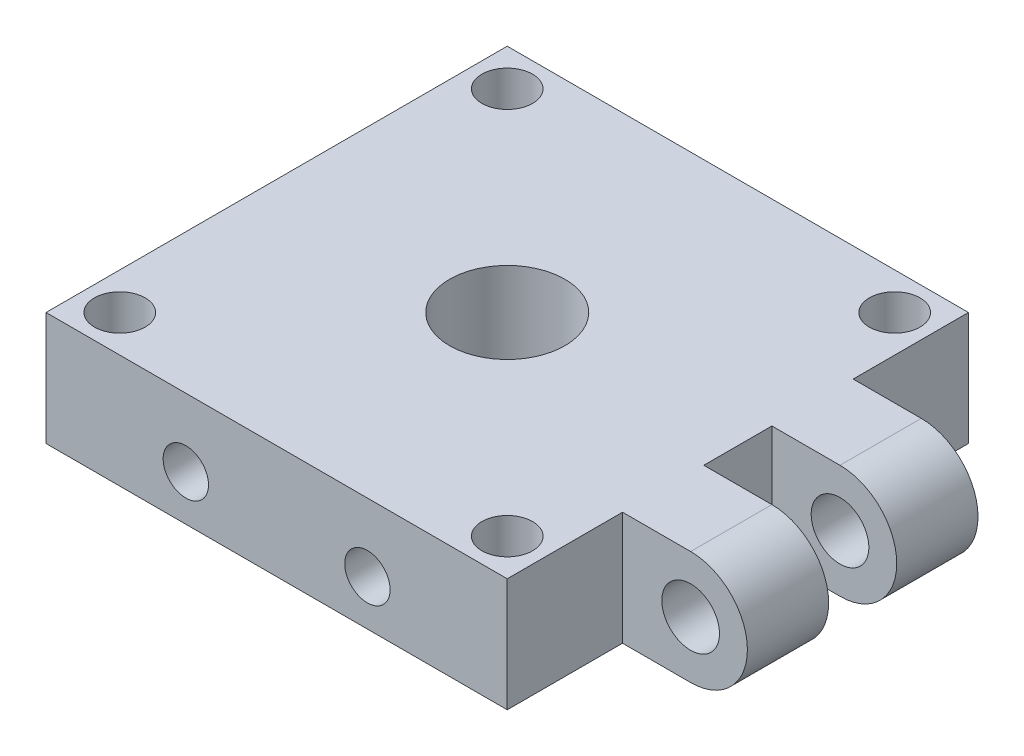
ISO-10303-21;
HEADER;
FILE_DESCRIPTION(('STEP AP214'),'2;1');
FILE_NAME('part.step','',(''),(''),'','','');
FILE_SCHEMA(('AUTOMOTIVE_DESIGN { 1 0 10303 214 1 1 1 1 }'));
ENDSEC;
DATA;
#1=APPLICATION_CONTEXT('core data for automotive mechanical design processes');
#2=APPLICATION_PROTOCOL_DEFINITION('international standard','automotive_design',2000,#1);
#3=PRODUCT_CONTEXT('',#1,'mechanical');
#4=PRODUCT('Part','Part','',(#3));
#5=PRODUCT_RELATED_PRODUCT_CATEGORY('part','',(#4));
#6=PRODUCT_DEFINITION_FORMATION('','',#4);
#7=PRODUCT_DEFINITION_CONTEXT('part definition',#1,'design');
#8=PRODUCT_DEFINITION('design','',#6,#7);
#9=PRODUCT_DEFINITION_SHAPE('','',#8);
#10=(LENGTH_UNIT() NAMED_UNIT(*) SI_UNIT(.MILLI.,.METRE.));
#11=(NAMED_UNIT(*) PLANE_ANGLE_UNIT() SI_UNIT($,.RADIAN.));
#12=(NAMED_UNIT(*) SI_UNIT($,.STERADIAN.) SOLID_ANGLE_UNIT());
#13=UNCERTAINTY_MEASURE_WITH_UNIT(LENGTH_MEASURE(1.E-05),#10,'distance_accuracy_value','');
#14=(GEOMETRIC_REPRESENTATION_CONTEXT(3) GLOBAL_UNCERTAINTY_ASSIGNED_CONTEXT((#13)) GLOBAL_UNIT_ASSIGNED_CONTEXT((#10,
#11,#12)) REPRESENTATION_CONTEXT('',''));
#15=CARTESIAN_POINT('',(0.,0.,0.));
#16=DIRECTION('',(0.,0.,1.));
#17=DIRECTION('',(1.,0.,0.));
#18=AXIS2_PLACEMENT_3D('',#15,#16,#17);
#19=CARTESIAN_POINT('',(-10.,5.,5.4));
#20=DIRECTION('',(0.,0.,1.));
#21=DIRECTION('',(1.,0.,0.));
#22=AXIS2_PLACEMENT_3D('',#19,#20,#21);
#23=CYLINDRICAL_SURFACE('',#22,2.5);
#24=CARTESIAN_POINT('',(-10.,5.,25.4));
#25=DIRECTION('',(0.,0.,1.));
#26=DIRECTION('',(1.,0.,0.));
#27=AXIS2_PLACEMENT_3D('',#24,#25,#26);
#28=CIRCLE('',#27,2.5);
#29=CARTESIAN_POINT('',(-7.5,5.,25.4));
#30=VERTEX_POINT('',#29);
#31=EDGE_CURVE('E282',#30,#30,#28,.T.);
#32=ORIENTED_EDGE('',*,*,#31,.T.);
#33=EDGE_LOOP('',(#32));
#34=FACE_BOUND('',#33,.T.);
#35=CARTESIAN_POINT('',(-10.,5.,10.));
#36=DIRECTION('',(0.707106781186547,0.,0.707106781186547));
#37=DIRECTION('',(-0.707106781186547,0.,0.707106781186547));
#38=AXIS2_PLACEMENT_3D('',#35,#36,#37);
#39=ELLIPSE('',#38,3.53553390593274,2.5);
#40=CARTESIAN_POINT('',(-10.,2.5,10.));
#41=VERTEX_POINT('',#40);
#42=CARTESIAN_POINT('',(-10.,7.5,10.));
#43=VERTEX_POINT('',#42);
#44=EDGE_CURVE('E54',#41,#43,#39,.F.);
#45=ORIENTED_EDGE('',*,*,#44,.T.);
#46=CARTESIAN_POINT('',(-10.,5.,10.));
#47=DIRECTION('',(-0.707106781186547,0.,0.707106781186547));
#48=DIRECTION('',(0.707106781186547,0.,0.707106781186547));
#49=AXIS2_PLACEMENT_3D('',#46,#47,#48);
#50=ELLIPSE('',#49,3.53553390593274,2.5);
#51=EDGE_CURVE('E11',#43,#41,#50,.F.);
#52=ORIENTED_EDGE('',*,*,#51,.T.);
#53=EDGE_LOOP('',(#45,#52));
#54=FACE_BOUND('',#53,.T.);
#55=ADVANCED_FACE('F41',(#34,#54),#23,.F.);
#56=CARTESIAN_POINT('',(32.9,6.25,12.7));
#57=DIRECTION('',(0.,0.,-1.));
#58=DIRECTION('',(-1.,0.,0.));
#59=AXIS2_PLACEMENT_3D('',#56,#57,#58);
#60=CYLINDRICAL_SURFACE('',#59,6.25);
#61=CARTESIAN_POINT('',(32.9,6.25,3.75));
#62=DIRECTION('',(0.,0.,1.));
#63=DIRECTION('',(1.,0.,0.));
#64=AXIS2_PLACEMENT_3D('',#61,#62,#63);
#65=CIRCLE('',#64,6.25);
#66=CARTESIAN_POINT('',(32.9,0.,3.75));
#67=VERTEX_POINT('',#66);
#68=CARTESIAN_POINT('',(32.9,12.5,3.75));
#69=VERTEX_POINT('',#68);
#70=EDGE_CURVE('E151',#67,#69,#65,.T.);
#71=ORIENTED_EDGE('',*,*,#70,.T.);
#72=DIRECTION('',(0.,0.,-1.));
#73=VECTOR('',#72,1.);
#74=CARTESIAN_POINT('',(32.9,12.5,12.7));
#75=LINE('',#74,#73);
#76=CARTESIAN_POINT('',(32.9,12.5,12.7));
#77=VERTEX_POINT('',#76);
#78=EDGE_CURVE('E220',#77,#69,#75,.T.);
#79=ORIENTED_EDGE('',*,*,#78,.F.);
#80=CARTESIAN_POINT('',(32.9,6.25,12.7));
#81=DIRECTION('',(0.,0.,1.));
#82=DIRECTION('',(-1.,0.,0.));
#83=AXIS2_PLACEMENT_3D('',#80,#81,#82);
#84=CIRCLE('',#83,6.25);
#85=CARTESIAN_POINT('',(32.9,0.,12.7));
#86=VERTEX_POINT('',#85);
#87=EDGE_CURVE('E240',#86,#77,#84,.T.);
#88=ORIENTED_EDGE('',*,*,#87,.F.);
#89=DIRECTION('',(0.,0.,-1.));
#90=VECTOR('',#89,1.);
#91=CARTESIAN_POINT('',(32.9,0.,12.7));
#92=LINE('',#91,#90);
#93=EDGE_CURVE('E214',#86,#67,#92,.T.);
#94=ORIENTED_EDGE('',*,*,#93,.T.);
#95=EDGE_LOOP('',(#71,#79,#88,#94));
#96=FACE_BOUND('',#95,.T.);
#97=ADVANCED_FACE('F344',(#96),#60,.T.);
#98=CARTESIAN_POINT('',(32.9,6.25,12.7));
#99=DIRECTION('',(0.,0.,-1.));
#100=DIRECTION('',(-1.,0.,0.));
#101=AXIS2_PLACEMENT_3D('',#98,#99,#100);
#102=CYLINDRICAL_SURFACE('',#101,3.175);
#103=CARTESIAN_POINT('',(32.9,6.25,3.75));
#104=DIRECTION('',(0.,0.,1.));
#105=DIRECTION('',(1.,0.,0.));
#106=AXIS2_PLACEMENT_3D('',#103,#104,#105);
#107=CIRCLE('',#106,3.175);
#108=CARTESIAN_POINT('',(36.075,6.25,3.75));
#109=VERTEX_POINT('',#108);
#110=EDGE_CURVE('E148',#109,#109,#107,.T.);
#111=ORIENTED_EDGE('',*,*,#110,.F.);
#112=EDGE_LOOP('',(#111));
#113=FACE_BOUND('',#112,.T.);
#114=CARTESIAN_POINT('',(32.9,6.25,12.7));
#115=DIRECTION('',(0.,0.,1.));
#116=DIRECTION('',(1.,0.,0.));
#117=AXIS2_PLACEMENT_3D('',#114,#115,#116);
#118=CIRCLE('',#117,3.175);
#119=CARTESIAN_POINT('',(36.075,6.25,12.7));
#120=VERTEX_POINT('',#119);
#121=EDGE_CURVE('E236',#120,#120,#118,.T.);
#122=ORIENTED_EDGE('',*,*,#121,.T.);
#123=EDGE_LOOP('',(#122));
#124=FACE_BOUND('',#123,.T.);
#125=ADVANCED_FACE('F378',(#113,#124),#102,.F.);
#126=CARTESIAN_POINT('',(25.4,12.5,25.4));
#127=DIRECTION('',(-1.,0.,0.));
#128=DIRECTION('',(0.,0.,1.));
#129=AXIS2_PLACEMENT_3D('',#126,#127,#128);
#130=PLANE('',#129);
#131=DIRECTION('',(0.,-1.,0.));
#132=VECTOR('',#131,1.);
#133=CARTESIAN_POINT('',(25.4,0.,12.7));
#134=LINE('',#133,#132);
#135=CARTESIAN_POINT('',(25.4,12.5,12.7));
#136=VERTEX_POINT('',#135);
#137=CARTESIAN_POINT('',(25.4,0.,12.7));
#138=VERTEX_POINT('',#137);
#139=EDGE_CURVE('E227',#136,#138,#134,.T.);
#140=ORIENTED_EDGE('',*,*,#139,.F.);
#141=DIRECTION('',(0.,0.,-1.));
#142=VECTOR('',#141,1.);
#143=CARTESIAN_POINT('',(25.4,12.5,25.4));
#144=LINE('',#143,#142);
#145=CARTESIAN_POINT('',(25.4,12.5,25.4));
#146=VERTEX_POINT('',#145);
#147=EDGE_CURVE('E183',#146,#136,#144,.T.);
#148=ORIENTED_EDGE('',*,*,#147,.F.);
#149=DIRECTION('',(0.,-1.,0.));
#150=VECTOR('',#149,1.);
#151=CARTESIAN_POINT('',(25.4,12.5,25.4));
#152=LINE('',#151,#150);
#153=CARTESIAN_POINT('',(25.4,0.,25.4));
#154=VERTEX_POINT('',#153);
#155=EDGE_CURVE('E164',#146,#154,#152,.T.);
#156=ORIENTED_EDGE('',*,*,#155,.T.);
#157=DIRECTION('',(0.,0.,-1.));
#158=VECTOR('',#157,1.);
#159=CARTESIAN_POINT('',(25.4,0.,25.4));
#160=LINE('',#159,#158);
#161=EDGE_CURVE('E175',#154,#138,#160,.T.);
#162=ORIENTED_EDGE('',*,*,#161,.T.);
#163=EDGE_LOOP('',(#140,#148,#156,#162));
#164=FACE_BOUND('',#163,.T.);
#165=ADVANCED_FACE('F332',(#164),#130,.F.);
#166=CARTESIAN_POINT('',(0.,12.5,0.));
#167=DIRECTION('',(0.,-1.,0.));
#168=DIRECTION('',(0.,0.,-1.));
#169=AXIS2_PLACEMENT_3D('',#166,#167,#168);
#170=PLANE('',#169);
#171=ORIENTED_EDGE('',*,*,#78,.T.);
#172=DIRECTION('',(1.,0.,0.));
#173=VECTOR('',#172,1.);
#174=CARTESIAN_POINT('',(25.4,12.5,3.75));
#175=LINE('',#174,#173);
#176=CARTESIAN_POINT('',(25.4,12.5,3.75));
#177=VERTEX_POINT('',#176);
#178=EDGE_CURVE('E258',#177,#69,#175,.T.);
#179=ORIENTED_EDGE('',*,*,#178,.F.);
#180=DIRECTION('',(0.,0.,1.));
#181=VECTOR('',#180,1.);
#182=CARTESIAN_POINT('',(25.4,12.5,-3.75));
#183=LINE('',#182,#181);
#184=CARTESIAN_POINT('',(25.4,12.5,-3.75));
#185=VERTEX_POINT('',#184);
#186=EDGE_CURVE('E262',#185,#177,#183,.T.);
#187=ORIENTED_EDGE('',*,*,#186,.F.);
#188=DIRECTION('',(-1.,0.,0.));
#189=VECTOR('',#188,1.);
#190=CARTESIAN_POINT('',(25.4,12.5,-3.75));
#191=LINE('',#190,#189);
#192=CARTESIAN_POINT('',(32.9,12.5,-3.75));
#193=VERTEX_POINT('',#192);
#194=EDGE_CURVE('E265',#193,#185,#191,.T.);
#195=ORIENTED_EDGE('',*,*,#194,.F.);
#196=CARTESIAN_POINT('',(32.9,12.5,-12.7));
#197=VERTEX_POINT('',#196);
#198=EDGE_CURVE('E223',#193,#197,#75,.T.);
#199=ORIENTED_EDGE('',*,*,#198,.T.);
#200=DIRECTION('',(-1.,0.,0.));
#201=VECTOR('',#200,1.);
#202=CARTESIAN_POINT('',(25.4,12.5,-12.7));
#203=LINE('',#202,#201);
#204=CARTESIAN_POINT('',(25.4,12.5,-12.7));
#205=VERTEX_POINT('',#204);
#206=EDGE_CURVE('E224',#197,#205,#203,.T.);
#207=ORIENTED_EDGE('',*,*,#206,.T.);
#208=CARTESIAN_POINT('',(25.4,12.5,-25.4));
#209=VERTEX_POINT('',#208);
#210=EDGE_CURVE('E170',#205,#209,#144,.T.);
#211=ORIENTED_EDGE('',*,*,#210,.T.);
#212=DIRECTION('',(-1.,0.,0.));
#213=VECTOR('',#212,1.);
#214=CARTESIAN_POINT('',(-25.4,12.5,-25.4));
#215=LINE('',#214,#213);
#216=CARTESIAN_POINT('',(-25.4,12.5,-25.4));
#217=VERTEX_POINT('',#216);
#218=EDGE_CURVE('E181',#209,#217,#215,.T.);
#219=ORIENTED_EDGE('',*,*,#218,.T.);
#220=DIRECTION('',(0.,0.,1.));
#221=VECTOR('',#220,1.);
#222=CARTESIAN_POINT('',(-25.4,12.5,25.4));
#223=LINE('',#222,#221);
#224=CARTESIAN_POINT('',(-25.4,12.5,25.4));
#225=VERTEX_POINT('',#224);
#226=EDGE_CURVE('E179',#217,#225,#223,.T.);
#227=ORIENTED_EDGE('',*,*,#226,.T.);
#228=DIRECTION('',(1.,0.,0.));
#229=VECTOR('',#228,1.);
#230=CARTESIAN_POINT('',(-25.4,12.5,25.4));
#231=LINE('',#230,#229);
#232=EDGE_CURVE('E167',#225,#146,#231,.T.);
#233=ORIENTED_EDGE('',*,*,#232,.T.);
#234=ORIENTED_EDGE('',*,*,#147,.T.);
#235=DIRECTION('',(-1.,0.,0.));
#236=VECTOR('',#235,1.);
#237=CARTESIAN_POINT('',(25.4,12.5,12.7));
#238=LINE('',#237,#236);
#239=EDGE_CURVE('E237',#77,#136,#238,.T.);
#240=ORIENTED_EDGE('',*,*,#239,.F.);
#241=EDGE_LOOP('',(#171,#179,#187,#195,#199,#207,#211,#219,#227,#233,#234,#240));
#242=FACE_BOUND('',#241,.T.);
#243=CARTESIAN_POINT('',(-21.336,12.5,21.336));
#244=DIRECTION('',(0.,1.,0.));
#245=DIRECTION('',(0.,0.,1.));
#246=AXIS2_PLACEMENT_3D('',#243,#244,#245);
#247=CIRCLE('',#246,2.794);
#248=CARTESIAN_POINT('',(-21.336,12.5,24.13));
#249=VERTEX_POINT('',#248);
#250=EDGE_CURVE('E189',#249,#249,#247,.T.);
#251=ORIENTED_EDGE('',*,*,#250,.F.);
#252=EDGE_LOOP('',(#251));
#253=FACE_BOUND('',#252,.T.);
#254=CARTESIAN_POINT('',(21.336,12.5,21.336));
#255=DIRECTION('',(0.,1.,0.));
#256=DIRECTION('',(0.,0.,1.));
#257=AXIS2_PLACEMENT_3D('',#254,#255,#256);
#258=CIRCLE('',#257,2.794);
#259=CARTESIAN_POINT('',(21.336,12.5,24.13));
#260=VERTEX_POINT('',#259);
#261=EDGE_CURVE('E190',#260,#260,#258,.T.);
#262=ORIENTED_EDGE('',*,*,#261,.F.);
#263=EDGE_LOOP('',(#262));
#264=FACE_BOUND('',#263,.T.);
#265=CARTESIAN_POINT('',(21.336,12.5,-21.336));
#266=DIRECTION('',(0.,1.,0.));
#267=DIRECTION('',(0.,0.,1.));
#268=AXIS2_PLACEMENT_3D('',#265,#266,#267);
#269=CIRCLE('',#268,2.794);
#270=CARTESIAN_POINT('',(21.336,12.5,-18.542));
#271=VERTEX_POINT('',#270);
#272=EDGE_CURVE('E196',#271,#271,#269,.T.);
#273=ORIENTED_EDGE('',*,*,#272,.F.);
#274=EDGE_LOOP('',(#273));
#275=FACE_BOUND('',#274,.T.);
#276=CARTESIAN_POINT('',(-21.336,12.5,-21.336));
#277=DIRECTION('',(0.,1.,0.));
#278=DIRECTION('',(0.,0.,1.));
#279=AXIS2_PLACEMENT_3D('',#276,#277,#278);
#280=CIRCLE('',#279,2.794);
#281=CARTESIAN_POINT('',(-21.336,12.5,-18.542));
#282=VERTEX_POINT('',#281);
#283=EDGE_CURVE('E202',#282,#282,#280,.T.);
#284=ORIENTED_EDGE('',*,*,#283,.F.);
#285=EDGE_LOOP('',(#284));
#286=FACE_BOUND('',#285,.T.);
#287=CARTESIAN_POINT('',(0.,12.5,0.));
#288=DIRECTION('',(0.,1.,0.));
#289=DIRECTION('',(0.,0.,1.));
#290=AXIS2_PLACEMENT_3D('',#287,#288,#289);
#291=CIRCLE('',#290,6.35);
#292=CARTESIAN_POINT('',(0.,12.5,6.35000000000001));
#293=VERTEX_POINT('',#292);
#294=EDGE_CURVE('E208',#293,#293,#291,.T.);
#295=ORIENTED_EDGE('',*,*,#294,.F.);
#296=EDGE_LOOP('',(#295));
#297=FACE_BOUND('',#296,.T.);
#298=ADVANCED_FACE('F336',(#242,#253,#264,#275,#286,#297),#170,.F.);
#299=CARTESIAN_POINT('',(0.,0.,0.));
#300=DIRECTION('',(0.,-1.,0.));
#301=DIRECTION('',(0.,0.,-1.));
#302=AXIS2_PLACEMENT_3D('',#299,#300,#301);
#303=PLANE('',#302);
#304=DIRECTION('',(1.,0.,0.));
#305=VECTOR('',#304,1.);
#306=CARTESIAN_POINT('',(25.4,0.,3.75));
#307=LINE('',#306,#305);
#308=CARTESIAN_POINT('',(25.4,0.,3.75));
#309=VERTEX_POINT('',#308);
#310=EDGE_CURVE('E256',#309,#67,#307,.T.);
#311=ORIENTED_EDGE('',*,*,#310,.T.);
#312=ORIENTED_EDGE('',*,*,#93,.F.);
#313=DIRECTION('',(1.,0.,0.));
#314=VECTOR('',#313,1.);
#315=CARTESIAN_POINT('',(25.4,0.,12.7));
#316=LINE('',#315,#314);
#317=EDGE_CURVE('E242',#138,#86,#316,.T.);
#318=ORIENTED_EDGE('',*,*,#317,.F.);
#319=ORIENTED_EDGE('',*,*,#161,.F.);
#320=DIRECTION('',(1.,0.,0.));
#321=VECTOR('',#320,1.);
#322=CARTESIAN_POINT('',(-25.4,0.,25.4));
#323=LINE('',#322,#321);
#324=CARTESIAN_POINT('',(-25.4,0.,25.4));
#325=VERTEX_POINT('',#324);
#326=EDGE_CURVE('E168',#325,#154,#323,.T.);
#327=ORIENTED_EDGE('',*,*,#326,.F.);
#328=DIRECTION('',(0.,0.,1.));
#329=VECTOR('',#328,1.);
#330=CARTESIAN_POINT('',(-25.4,0.,25.4));
#331=LINE('',#330,#329);
#332=CARTESIAN_POINT('',(-25.4,0.,-25.4));
#333=VERTEX_POINT('',#332);
#334=EDGE_CURVE('E171',#333,#325,#331,.T.);
#335=ORIENTED_EDGE('',*,*,#334,.F.);
#336=DIRECTION('',(-1.,0.,0.));
#337=VECTOR('',#336,1.);
#338=CARTESIAN_POINT('',(-25.4,0.,-25.4));
#339=LINE('',#338,#337);
#340=CARTESIAN_POINT('',(25.4,0.,-25.4));
#341=VERTEX_POINT('',#340);
#342=EDGE_CURVE('E173',#341,#333,#339,.T.);
#343=ORIENTED_EDGE('',*,*,#342,.F.);
#344=CARTESIAN_POINT('',(25.4,0.,-12.7));
#345=VERTEX_POINT('',#344);
#346=EDGE_CURVE('E177',#345,#341,#160,.T.);
#347=ORIENTED_EDGE('',*,*,#346,.F.);
#348=DIRECTION('',(1.,0.,0.));
#349=VECTOR('',#348,1.);
#350=CARTESIAN_POINT('',(25.4,0.,-12.7));
#351=LINE('',#350,#349);
#352=CARTESIAN_POINT('',(32.9,0.,-12.7));
#353=VERTEX_POINT('',#352);
#354=EDGE_CURVE('E231',#345,#353,#351,.T.);
#355=ORIENTED_EDGE('',*,*,#354,.T.);
#356=CARTESIAN_POINT('',(32.9,0.,-3.75));
#357=VERTEX_POINT('',#356);
#358=EDGE_CURVE('E219',#357,#353,#92,.T.);
#359=ORIENTED_EDGE('',*,*,#358,.F.);
#360=DIRECTION('',(-1.,0.,0.));
#361=VECTOR('',#360,1.);
#362=CARTESIAN_POINT('',(25.4,0.,-3.75));
#363=LINE('',#362,#361);
#364=CARTESIAN_POINT('',(25.4,0.,-3.75));
#365=VERTEX_POINT('',#364);
#366=EDGE_CURVE('E261',#357,#365,#363,.T.);
#367=ORIENTED_EDGE('',*,*,#366,.T.);
#368=DIRECTION('',(0.,0.,1.));
#369=VECTOR('',#368,1.);
#370=CARTESIAN_POINT('',(25.4,0.,-3.75));
#371=LINE('',#370,#369);
#372=EDGE_CURVE('E270',#365,#309,#371,.T.);
#373=ORIENTED_EDGE('',*,*,#372,.T.);
#374=EDGE_LOOP('',(#311,#312,#318,#319,#327,#335,#343,#347,#355,#359,#367,#373));
#375=FACE_BOUND('',#374,.T.);
#376=CARTESIAN_POINT('',(-21.336,0.,-21.336));
#377=DIRECTION('',(0.,1.,0.));
#378=DIRECTION('',(0.,0.,1.));
#379=AXIS2_PLACEMENT_3D('',#376,#377,#378);
#380=CIRCLE('',#379,2.794);
#381=CARTESIAN_POINT('',(-21.336,0.,-18.542));
#382=VERTEX_POINT('',#381);
#383=EDGE_CURVE('E205',#382,#382,#380,.T.);
#384=ORIENTED_EDGE('',*,*,#383,.T.);
#385=EDGE_LOOP('',(#384));
#386=FACE_BOUND('',#385,.T.);
#387=CARTESIAN_POINT('',(21.336,0.,21.336));
#388=DIRECTION('',(0.,1.,0.));
#389=DIRECTION('',(0.,0.,1.));
#390=AXIS2_PLACEMENT_3D('',#387,#388,#389);
#391=CIRCLE('',#390,2.794);
#392=CARTESIAN_POINT('',(21.336,0.,24.13));
#393=VERTEX_POINT('',#392);
#394=EDGE_CURVE('E193',#393,#393,#391,.T.);
#395=ORIENTED_EDGE('',*,*,#394,.T.);
#396=EDGE_LOOP('',(#395));
#397=FACE_BOUND('',#396,.T.);
#398=CARTESIAN_POINT('',(-21.336,0.,21.336));
#399=DIRECTION('',(0.,1.,0.));
#400=DIRECTION('',(0.,0.,1.));
#401=AXIS2_PLACEMENT_3D('',#398,#399,#400);
#402=CIRCLE('',#401,2.794);
#403=CARTESIAN_POINT('',(-21.336,0.,24.13));
#404=VERTEX_POINT('',#403);
#405=EDGE_CURVE('E186',#404,#404,#402,.T.);
#406=ORIENTED_EDGE('',*,*,#405,.T.);
#407=EDGE_LOOP('',(#406));
#408=FACE_BOUND('',#407,.T.);
#409=CARTESIAN_POINT('',(21.336,0.,-21.336));
#410=DIRECTION('',(0.,1.,0.));
#411=DIRECTION('',(0.,0.,1.));
#412=AXIS2_PLACEMENT_3D('',#409,#410,#411);
#413=CIRCLE('',#412,2.794);
#414=CARTESIAN_POINT('',(21.336,0.,-18.542));
#415=VERTEX_POINT('',#414);
#416=EDGE_CURVE('E199',#415,#415,#413,.T.);
#417=ORIENTED_EDGE('',*,*,#416,.T.);
#418=EDGE_LOOP('',(#417));
#419=FACE_BOUND('',#418,.T.);
#420=CARTESIAN_POINT('',(0.,0.,0.));
#421=DIRECTION('',(0.,1.,0.));
#422=DIRECTION('',(0.,0.,1.));
#423=AXIS2_PLACEMENT_3D('',#420,#421,#422);
#424=CIRCLE('',#423,6.35);
#425=CARTESIAN_POINT('',(0.,0.,6.35000000000001));
#426=VERTEX_POINT('',#425);
#427=EDGE_CURVE('E211',#426,#426,#424,.T.);
#428=ORIENTED_EDGE('',*,*,#427,.T.);
#429=EDGE_LOOP('',(#428));
#430=FACE_BOUND('',#429,.T.);
#431=ADVANCED_FACE('F327',(#375,#386,#397,#408,#419,#430),#303,.T.);
#432=ORIENTED_EDGE('',*,*,#210,.F.);
#433=DIRECTION('',(0.,-1.,0.));
#434=VECTOR('',#433,1.);
#435=CARTESIAN_POINT('',(25.4,0.,-12.7));
#436=LINE('',#435,#434);
#437=EDGE_CURVE('E234',#205,#345,#436,.T.);
#438=ORIENTED_EDGE('',*,*,#437,.T.);
#439=ORIENTED_EDGE('',*,*,#346,.T.);
#440=DIRECTION('',(0.,-1.,0.));
#441=VECTOR('',#440,1.);
#442=CARTESIAN_POINT('',(25.4,12.5,-25.4));
#443=LINE('',#442,#441);
#444=EDGE_CURVE('E143',#209,#341,#443,.T.);
#445=ORIENTED_EDGE('',*,*,#444,.F.);
#446=EDGE_LOOP('',(#432,#438,#439,#445));
#447=FACE_BOUND('',#446,.T.);
#448=ADVANCED_FACE('F43',(#447),#130,.F.);
#449=CARTESIAN_POINT('',(-25.4,12.5,-25.4));
#450=DIRECTION('',(0.,0.,1.));
#451=DIRECTION('',(1.,0.,0.));
#452=AXIS2_PLACEMENT_3D('',#449,#450,#451);
#453=PLANE('',#452);
#454=ORIENTED_EDGE('',*,*,#342,.T.);
#455=DIRECTION('',(0.,-1.,0.));
#456=VECTOR('',#455,1.);
#457=CARTESIAN_POINT('',(-25.4,12.5,-25.4));
#458=LINE('',#457,#456);
#459=EDGE_CURVE('E158',#217,#333,#458,.T.);
#460=ORIENTED_EDGE('',*,*,#459,.F.);
#461=ORIENTED_EDGE('',*,*,#218,.F.);
#462=ORIENTED_EDGE('',*,*,#444,.T.);
#463=EDGE_LOOP('',(#454,#460,#461,#462));
#464=FACE_BOUND('',#463,.T.);
#465=ADVANCED_FACE('F312',(#464),#453,.F.);
#466=CARTESIAN_POINT('',(-25.4,12.5,25.4));
#467=DIRECTION('',(1.,0.,0.));
#468=DIRECTION('',(0.,0.,-1.));
#469=AXIS2_PLACEMENT_3D('',#466,#467,#468);
#470=PLANE('',#469);
#471=CARTESIAN_POINT('',(-25.4,5.,-10.));
#472=DIRECTION('',(-1.,0.,0.));
#473=DIRECTION('',(0.,0.,1.));
#474=AXIS2_PLACEMENT_3D('',#471,#472,#473);
#475=CIRCLE('',#474,2.5);
#476=CARTESIAN_POINT('',(-25.4,5.,-7.5));
#477=VERTEX_POINT('',#476);
#478=EDGE_CURVE('E293',#477,#477,#475,.T.);
#479=ORIENTED_EDGE('',*,*,#478,.F.);
#480=EDGE_LOOP('',(#479));
#481=FACE_BOUND('',#480,.T.);
#482=CARTESIAN_POINT('',(-25.4,5.,10.));
#483=DIRECTION('',(-1.,0.,0.));
#484=DIRECTION('',(0.,0.,1.));
#485=AXIS2_PLACEMENT_3D('',#482,#483,#484);
#486=CIRCLE('',#485,2.5);
#487=CARTESIAN_POINT('',(-25.4,5.,12.5));
#488=VERTEX_POINT('',#487);
#489=EDGE_CURVE('E290',#488,#488,#486,.T.);
#490=ORIENTED_EDGE('',*,*,#489,.F.);
#491=EDGE_LOOP('',(#490));
#492=FACE_BOUND('',#491,.T.);
#493=ORIENTED_EDGE('',*,*,#334,.T.);
#494=DIRECTION('',(0.,-1.,0.));
#495=VECTOR('',#494,1.);
#496=CARTESIAN_POINT('',(-25.4,12.5,25.4));
#497=LINE('',#496,#495);
#498=EDGE_CURVE('E161',#225,#325,#497,.T.);
#499=ORIENTED_EDGE('',*,*,#498,.F.);
#500=ORIENTED_EDGE('',*,*,#226,.F.);
#501=ORIENTED_EDGE('',*,*,#459,.T.);
#502=EDGE_LOOP('',(#493,#499,#500,#501));
#503=FACE_BOUND('',#502,.T.);
#504=ADVANCED_FACE('F308',(#481,#492,#503),#470,.F.);
#505=CARTESIAN_POINT('',(-25.4,12.5,25.4));
#506=DIRECTION('',(0.,0.,-1.));
#507=DIRECTION('',(-1.,0.,0.));
#508=AXIS2_PLACEMENT_3D('',#505,#506,#507);
#509=PLANE('',#508);
#510=ORIENTED_EDGE('',*,*,#31,.F.);
#511=EDGE_LOOP('',(#510));
#512=FACE_BOUND('',#511,.T.);
#513=CARTESIAN_POINT('',(10.,5.,25.4));
#514=DIRECTION('',(0.,0.,1.));
#515=DIRECTION('',(1.,0.,0.));
#516=AXIS2_PLACEMENT_3D('',#513,#514,#515);
#517=CIRCLE('',#516,2.5);
#518=CARTESIAN_POINT('',(12.5,5.,25.4));
#519=VERTEX_POINT('',#518);
#520=EDGE_CURVE('E278',#519,#519,#517,.T.);
#521=ORIENTED_EDGE('',*,*,#520,.F.);
#522=EDGE_LOOP('',(#521));
#523=FACE_BOUND('',#522,.T.);
#524=ORIENTED_EDGE('',*,*,#326,.T.);
#525=ORIENTED_EDGE('',*,*,#155,.F.);
#526=ORIENTED_EDGE('',*,*,#232,.F.);
#527=ORIENTED_EDGE('',*,*,#498,.T.);
#528=EDGE_LOOP('',(#524,#525,#526,#527));
#529=FACE_BOUND('',#528,.T.);
#530=ADVANCED_FACE('F311',(#512,#523,#529),#509,.F.);
#531=CARTESIAN_POINT('',(-21.336,12.5,21.336));
#532=DIRECTION('',(0.,-1.,0.));
#533=DIRECTION('',(0.,0.,-1.));
#534=AXIS2_PLACEMENT_3D('',#531,#532,#533);
#535=CYLINDRICAL_SURFACE('',#534,2.794);
#536=ORIENTED_EDGE('',*,*,#250,.T.);
#537=EDGE_LOOP('',(#536));
#538=FACE_BOUND('',#537,.T.);
#539=ORIENTED_EDGE('',*,*,#405,.F.);
#540=EDGE_LOOP('',(#539));
#541=FACE_BOUND('',#540,.T.);
#542=ADVANCED_FACE('F595',(#538,#541),#535,.F.);
#543=CARTESIAN_POINT('',(21.336,12.5,21.336));
#544=DIRECTION('',(0.,-1.,0.));
#545=DIRECTION('',(0.,0.,-1.));
#546=AXIS2_PLACEMENT_3D('',#543,#544,#545);
#547=CYLINDRICAL_SURFACE('',#546,2.794);
#548=ORIENTED_EDGE('',*,*,#261,.T.);
#549=EDGE_LOOP('',(#548));
#550=FACE_BOUND('',#549,.T.);
#551=ORIENTED_EDGE('',*,*,#394,.F.);
#552=EDGE_LOOP('',(#551));
#553=FACE_BOUND('',#552,.T.);
#554=ADVANCED_FACE('F585',(#550,#553),#547,.F.);
#555=CARTESIAN_POINT('',(21.336,12.5,-21.336));
#556=DIRECTION('',(0.,-1.,0.));
#557=DIRECTION('',(0.,0.,-1.));
#558=AXIS2_PLACEMENT_3D('',#555,#556,#557);
#559=CYLINDRICAL_SURFACE('',#558,2.794);
#560=ORIENTED_EDGE('',*,*,#272,.T.);
#561=EDGE_LOOP('',(#560));
#562=FACE_BOUND('',#561,.T.);
#563=ORIENTED_EDGE('',*,*,#416,.F.);
#564=EDGE_LOOP('',(#563));
#565=FACE_BOUND('',#564,.T.);
#566=ADVANCED_FACE('F575',(#562,#565),#559,.F.);
#567=CARTESIAN_POINT('',(-21.336,12.5,-21.336));
#568=DIRECTION('',(0.,-1.,0.));
#569=DIRECTION('',(0.,0.,-1.));
#570=AXIS2_PLACEMENT_3D('',#567,#568,#569);
#571=CYLINDRICAL_SURFACE('',#570,2.794);
#572=ORIENTED_EDGE('',*,*,#283,.T.);
#573=EDGE_LOOP('',(#572));
#574=FACE_BOUND('',#573,.T.);
#575=ORIENTED_EDGE('',*,*,#383,.F.);
#576=EDGE_LOOP('',(#575));
#577=FACE_BOUND('',#576,.T.);
#578=ADVANCED_FACE('F565',(#574,#577),#571,.F.);
#579=CARTESIAN_POINT('',(0.,12.5,0.));
#580=DIRECTION('',(0.,-1.,0.));
#581=DIRECTION('',(0.,0.,-1.));
#582=AXIS2_PLACEMENT_3D('',#579,#580,#581);
#583=CYLINDRICAL_SURFACE('',#582,6.35);
#584=ORIENTED_EDGE('',*,*,#294,.T.);
#585=EDGE_LOOP('',(#584));
#586=FACE_BOUND('',#585,.T.);
#587=ORIENTED_EDGE('',*,*,#427,.F.);
#588=EDGE_LOOP('',(#587));
#589=FACE_BOUND('',#588,.T.);
#590=ADVANCED_FACE('F533',(#586,#589),#583,.F.);
#591=CARTESIAN_POINT('',(32.9,6.25,12.7));
#592=DIRECTION('',(0.,0.,-1.));
#593=DIRECTION('',(-1.,0.,0.));
#594=AXIS2_PLACEMENT_3D('',#591,#592,#593);
#595=PLANE('',#594);
#596=ORIENTED_EDGE('',*,*,#139,.T.);
#597=ORIENTED_EDGE('',*,*,#317,.T.);
#598=ORIENTED_EDGE('',*,*,#87,.T.);
#599=ORIENTED_EDGE('',*,*,#239,.T.);
#600=EDGE_LOOP('',(#596,#597,#598,#599));
#601=FACE_BOUND('',#600,.T.);
#602=ORIENTED_EDGE('',*,*,#121,.F.);
#603=EDGE_LOOP('',(#602));
#604=FACE_BOUND('',#603,.T.);
#605=ADVANCED_FACE('F339',(#601,#604),#595,.F.);
#606=CARTESIAN_POINT('',(32.9,6.25,-12.7));
#607=DIRECTION('',(0.,0.,-1.));
#608=DIRECTION('',(-1.,0.,0.));
#609=AXIS2_PLACEMENT_3D('',#606,#607,#608);
#610=PLANE('',#609);
#611=ORIENTED_EDGE('',*,*,#437,.F.);
#612=ORIENTED_EDGE('',*,*,#206,.F.);
#613=CARTESIAN_POINT('',(32.9,6.25,-12.7));
#614=DIRECTION('',(0.,0.,1.));
#615=DIRECTION('',(-1.,0.,0.));
#616=AXIS2_PLACEMENT_3D('',#613,#614,#615);
#617=CIRCLE('',#616,6.25);
#618=EDGE_CURVE('E228',#353,#197,#617,.T.);
#619=ORIENTED_EDGE('',*,*,#618,.F.);
#620=ORIENTED_EDGE('',*,*,#354,.F.);
#621=EDGE_LOOP('',(#611,#612,#619,#620));
#622=FACE_BOUND('',#621,.T.);
#623=CARTESIAN_POINT('',(32.9,6.25,-12.7));
#624=DIRECTION('',(0.,0.,1.));
#625=DIRECTION('',(1.,0.,0.));
#626=AXIS2_PLACEMENT_3D('',#623,#624,#625);
#627=CIRCLE('',#626,3.175);
#628=CARTESIAN_POINT('',(36.075,6.25,-12.7));
#629=VERTEX_POINT('',#628);
#630=EDGE_CURVE('E246',#629,#629,#627,.T.);
#631=ORIENTED_EDGE('',*,*,#630,.T.);
#632=EDGE_LOOP('',(#631));
#633=FACE_BOUND('',#632,.T.);
#634=ADVANCED_FACE('F363',(#622,#633),#610,.T.);
#635=ORIENTED_EDGE('',*,*,#198,.F.);
#636=CARTESIAN_POINT('',(32.9,6.25,-3.75));
#637=DIRECTION('',(0.,0.,-1.));
#638=DIRECTION('',(-1.,0.,0.));
#639=AXIS2_PLACEMENT_3D('',#636,#637,#638);
#640=CIRCLE('',#639,6.25);
#641=EDGE_CURVE('E62',#193,#357,#640,.T.);
#642=ORIENTED_EDGE('',*,*,#641,.T.);
#643=ORIENTED_EDGE('',*,*,#358,.T.);
#644=ORIENTED_EDGE('',*,*,#618,.T.);
#645=EDGE_LOOP('',(#635,#642,#643,#644));
#646=FACE_BOUND('',#645,.T.);
#647=ADVANCED_FACE('F357',(#646),#60,.T.);
#648=CARTESIAN_POINT('',(32.9,6.25,-3.75));
#649=DIRECTION('',(0.,0.,-1.));
#650=DIRECTION('',(-1.,0.,0.));
#651=AXIS2_PLACEMENT_3D('',#648,#649,#650);
#652=CIRCLE('',#651,3.175);
#653=CARTESIAN_POINT('',(29.725,6.25,-3.75));
#654=VERTEX_POINT('',#653);
#655=EDGE_CURVE('E152',#654,#654,#652,.T.);
#656=ORIENTED_EDGE('',*,*,#655,.F.);
#657=EDGE_LOOP('',(#656));
#658=FACE_BOUND('',#657,.T.);
#659=ORIENTED_EDGE('',*,*,#630,.F.);
#660=EDGE_LOOP('',(#659));
#661=FACE_BOUND('',#660,.T.);
#662=ADVANCED_FACE('F488',(#658,#661),#102,.F.);
#663=CARTESIAN_POINT('',(25.4,0.,3.75));
#664=DIRECTION('',(0.,0.,1.));
#665=DIRECTION('',(1.,0.,0.));
#666=AXIS2_PLACEMENT_3D('',#663,#664,#665);
#667=PLANE('',#666);
#668=ORIENTED_EDGE('',*,*,#110,.T.);
#669=EDGE_LOOP('',(#668));
#670=FACE_BOUND('',#669,.T.);
#671=ORIENTED_EDGE('',*,*,#70,.F.);
#672=ORIENTED_EDGE('',*,*,#310,.F.);
#673=DIRECTION('',(0.,1.,0.));
#674=VECTOR('',#673,1.);
#675=CARTESIAN_POINT('',(25.4,0.,3.75));
#676=LINE('',#675,#674);
#677=EDGE_CURVE('E155',#309,#177,#676,.T.);
#678=ORIENTED_EDGE('',*,*,#677,.T.);
#679=ORIENTED_EDGE('',*,*,#178,.T.);
#680=EDGE_LOOP('',(#671,#672,#678,#679));
#681=FACE_BOUND('',#680,.T.);
#682=ADVANCED_FACE('F349',(#670,#681),#667,.F.);
#683=CARTESIAN_POINT('',(25.4,0.,-3.75));
#684=DIRECTION('',(0.,0.,-1.));
#685=DIRECTION('',(-1.,0.,0.));
#686=AXIS2_PLACEMENT_3D('',#683,#684,#685);
#687=PLANE('',#686);
#688=ORIENTED_EDGE('',*,*,#655,.T.);
#689=EDGE_LOOP('',(#688));
#690=FACE_BOUND('',#689,.T.);
#691=ORIENTED_EDGE('',*,*,#194,.T.);
#692=DIRECTION('',(0.,1.,0.));
#693=VECTOR('',#692,1.);
#694=CARTESIAN_POINT('',(25.4,0.,-3.75));
#695=LINE('',#694,#693);
#696=EDGE_CURVE('E253',#365,#185,#695,.T.);
#697=ORIENTED_EDGE('',*,*,#696,.F.);
#698=ORIENTED_EDGE('',*,*,#366,.F.);
#699=ORIENTED_EDGE('',*,*,#641,.F.);
#700=EDGE_LOOP('',(#691,#697,#698,#699));
#701=FACE_BOUND('',#700,.T.);
#702=ADVANCED_FACE('F355',(#690,#701),#687,.F.);
#703=CARTESIAN_POINT('',(25.4,0.,-3.75));
#704=DIRECTION('',(-1.,0.,0.));
#705=DIRECTION('',(0.,0.,1.));
#706=AXIS2_PLACEMENT_3D('',#703,#704,#705);
#707=PLANE('',#706);
#708=ORIENTED_EDGE('',*,*,#186,.T.);
#709=ORIENTED_EDGE('',*,*,#677,.F.);
#710=ORIENTED_EDGE('',*,*,#372,.F.);
#711=ORIENTED_EDGE('',*,*,#696,.T.);
#712=EDGE_LOOP('',(#708,#709,#710,#711));
#713=FACE_BOUND('',#712,.T.);
#714=ADVANCED_FACE('F353',(#713),#707,.F.);
#715=CARTESIAN_POINT('',(10.,5.,5.4));
#716=DIRECTION('',(0.,0.,1.));
#717=DIRECTION('',(1.,0.,0.));
#718=AXIS2_PLACEMENT_3D('',#715,#716,#717);
#719=CYLINDRICAL_SURFACE('',#718,2.5);
#720=CARTESIAN_POINT('',(10.,5.,5.4));
#721=DIRECTION('',(0.,0.,1.));
#722=DIRECTION('',(1.,0.,0.));
#723=AXIS2_PLACEMENT_3D('',#720,#721,#722);
#724=CIRCLE('',#723,2.5);
#725=CARTESIAN_POINT('',(12.5,5.,5.4));
#726=VERTEX_POINT('',#725);
#727=EDGE_CURVE('E275',#726,#726,#724,.T.);
#728=ORIENTED_EDGE('',*,*,#727,.F.);
#729=EDGE_LOOP('',(#728));
#730=FACE_BOUND('',#729,.T.);
#731=ORIENTED_EDGE('',*,*,#520,.T.);
#732=EDGE_LOOP('',(#731));
#733=FACE_BOUND('',#732,.T.);
#734=ADVANCED_FACE('F452',(#730,#733),#719,.F.);
#735=CARTESIAN_POINT('',(10.,5.,5.4));
#736=DIRECTION('',(0.,0.,1.));
#737=DIRECTION('',(1.,0.,0.));
#738=AXIS2_PLACEMENT_3D('',#735,#736,#737);
#739=PLANE('',#738);
#740=ORIENTED_EDGE('',*,*,#727,.T.);
#741=EDGE_LOOP('',(#740));
#742=FACE_BOUND('',#741,.T.);
#743=ADVANCED_FACE('F401',(#742),#739,.T.);
#744=CARTESIAN_POINT('',(-5.39999999999999,5.,10.));
#745=DIRECTION('',(-1.,0.,0.));
#746=DIRECTION('',(0.,0.,1.));
#747=AXIS2_PLACEMENT_3D('',#744,#745,#746);
#748=CYLINDRICAL_SURFACE('',#747,2.5);
#749=ORIENTED_EDGE('',*,*,#489,.T.);
#750=EDGE_LOOP('',(#749));
#751=FACE_BOUND('',#750,.T.);
#752=ORIENTED_EDGE('',*,*,#44,.F.);
#753=CARTESIAN_POINT('',(-10.,5.,10.));
#754=DIRECTION('',(-0.707106781186547,0.,0.707106781186547));
#755=DIRECTION('',(0.707106781186547,0.,0.707106781186547));
#756=AXIS2_PLACEMENT_3D('',#753,#754,#755);
#757=ELLIPSE('',#756,3.53553390593274,2.5);
#758=EDGE_CURVE('E49',#43,#41,#757,.T.);
#759=ORIENTED_EDGE('',*,*,#758,.F.);
#760=EDGE_LOOP('',(#752,#759));
#761=FACE_BOUND('',#760,.T.);
#762=ADVANCED_FACE('F142',(#751,#761),#748,.F.);
#763=CARTESIAN_POINT('',(-10.,5.,5.4));
#764=DIRECTION('',(0.,0.,1.));
#765=DIRECTION('',(1.,0.,0.));
#766=AXIS2_PLACEMENT_3D('',#763,#764,#765);
#767=PLANE('',#766);
#768=CARTESIAN_POINT('',(-10.,5.,5.4));
#769=DIRECTION('',(0.,0.,1.));
#770=DIRECTION('',(1.,0.,0.));
#771=AXIS2_PLACEMENT_3D('',#768,#769,#770);
#772=CIRCLE('',#771,2.5);
#773=CARTESIAN_POINT('',(-7.5,5.,5.4));
#774=VERTEX_POINT('',#773);
#775=EDGE_CURVE('E267',#774,#774,#772,.T.);
#776=ORIENTED_EDGE('',*,*,#775,.T.);
#777=EDGE_LOOP('',(#776));
#778=FACE_BOUND('',#777,.T.);
#779=ADVANCED_FACE('F390',(#778),#767,.T.);
#780=CARTESIAN_POINT('',(-10.,5.,10.));
#781=DIRECTION('',(0.707106781186547,0.,0.707106781186547));
#782=DIRECTION('',(-0.707106781186547,0.,0.707106781186547));
#783=AXIS2_PLACEMENT_3D('',#780,#781,#782);
#784=ELLIPSE('',#783,3.53553390593274,2.5);
#785=EDGE_CURVE('E136',#41,#43,#784,.T.);
#786=ORIENTED_EDGE('',*,*,#785,.T.);
#787=ORIENTED_EDGE('',*,*,#758,.T.);
#788=EDGE_LOOP('',(#786,#787));
#789=FACE_BOUND('',#788,.T.);
#790=ORIENTED_EDGE('',*,*,#775,.F.);
#791=EDGE_LOOP('',(#790));
#792=FACE_BOUND('',#791,.T.);
#793=ADVANCED_FACE('F145',(#789,#792),#23,.F.);
#794=CARTESIAN_POINT('',(-5.39999999999999,5.,10.));
#795=DIRECTION('',(-1.,0.,0.));
#796=DIRECTION('',(0.,0.,1.));
#797=AXIS2_PLACEMENT_3D('',#794,#795,#796);
#798=CIRCLE('',#797,2.5);
#799=CARTESIAN_POINT('',(-5.39999999999999,5.,12.5));
#800=VERTEX_POINT('',#799);
#801=EDGE_CURVE('E287',#800,#800,#798,.T.);
#802=ORIENTED_EDGE('',*,*,#801,.F.);
#803=EDGE_LOOP('',(#802));
#804=FACE_BOUND('',#803,.T.);
#805=ORIENTED_EDGE('',*,*,#785,.F.);
#806=ORIENTED_EDGE('',*,*,#51,.F.);
#807=EDGE_LOOP('',(#805,#806));
#808=FACE_BOUND('',#807,.T.);
#809=ADVANCED_FACE('F137',(#804,#808),#748,.F.);
#810=CARTESIAN_POINT('',(-5.39999999999999,5.,10.));
#811=DIRECTION('',(-1.,0.,0.));
#812=DIRECTION('',(0.,0.,1.));
#813=AXIS2_PLACEMENT_3D('',#810,#811,#812);
#814=PLANE('',#813);
#815=ORIENTED_EDGE('',*,*,#801,.T.);
#816=EDGE_LOOP('',(#815));
#817=FACE_BOUND('',#816,.T.);
#818=ADVANCED_FACE('F304',(#817),#814,.T.);
#819=CARTESIAN_POINT('',(-5.39999999999999,5.,-10.));
#820=DIRECTION('',(-1.,0.,0.));
#821=DIRECTION('',(0.,0.,1.));
#822=AXIS2_PLACEMENT_3D('',#819,#820,#821);
#823=CYLINDRICAL_SURFACE('',#822,2.5);
#824=CARTESIAN_POINT('',(-5.39999999999999,5.,-10.));
#825=DIRECTION('',(-1.,0.,0.));
#826=DIRECTION('',(0.,0.,1.));
#827=AXIS2_PLACEMENT_3D('',#824,#825,#826);
#828=CIRCLE('',#827,2.5);
#829=CARTESIAN_POINT('',(-5.39999999999999,5.,-7.5));
#830=VERTEX_POINT('',#829);
#831=EDGE_CURVE('E279',#830,#830,#828,.T.);
#832=ORIENTED_EDGE('',*,*,#831,.F.);
#833=EDGE_LOOP('',(#832));
#834=FACE_BOUND('',#833,.T.);
#835=ORIENTED_EDGE('',*,*,#478,.T.);
#836=EDGE_LOOP('',(#835));
#837=FACE_BOUND('',#836,.T.);
#838=ADVANCED_FACE('F301',(#834,#837),#823,.F.);
#839=CARTESIAN_POINT('',(-5.39999999999999,5.,-10.));
#840=DIRECTION('',(-1.,0.,0.));
#841=DIRECTION('',(0.,0.,1.));
#842=AXIS2_PLACEMENT_3D('',#839,#840,#841);
#843=PLANE('',#842);
#844=ORIENTED_EDGE('',*,*,#831,.T.);
#845=EDGE_LOOP('',(#844));
#846=FACE_BOUND('',#845,.T.);
#847=ADVANCED_FACE('F299',(#846),#843,.T.);
#848=CLOSED_SHELL('',(#55,#97,#125,#165,#298,#431,#448,#465,#504,#530,#542,#554,#566,#578,#590,
#605,#634,#647,#662,#682,#702,#714,#734,#743,#762,#779,#793,#809,#818,#838,#847));
#849=MANIFOLD_SOLID_BREP('B2',#848);
#850=ADVANCED_BREP_SHAPE_REPRESENTATION('',(#18,#849),#14);
#851=SHAPE_DEFINITION_REPRESENTATION(#9,#850);
ENDSEC;
END-ISO-10303-21;
